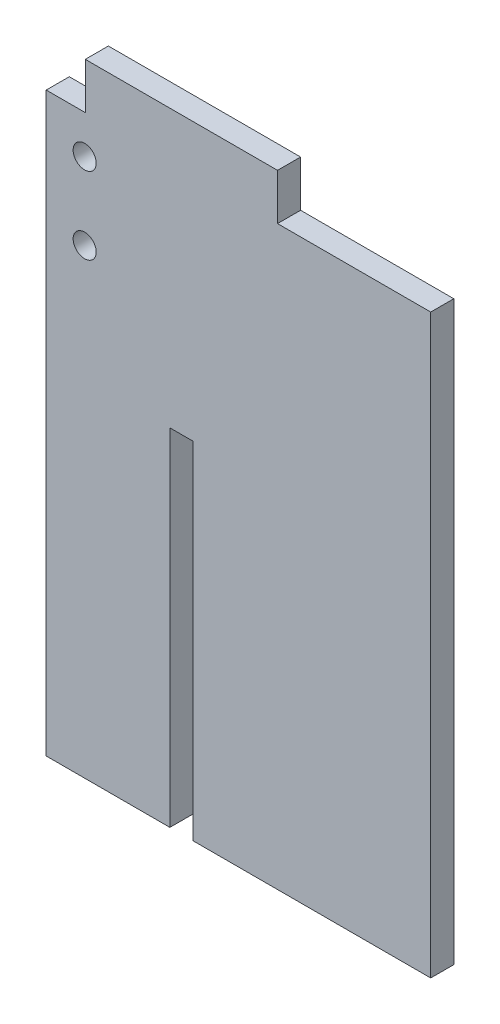
ISO-10303-21;
HEADER;
FILE_DESCRIPTION(('STEP AP214'),'2;1');
FILE_NAME('part.step','',(''),(''),'','','');
FILE_SCHEMA(('AUTOMOTIVE_DESIGN { 1 0 10303 214 1 1 1 1 }'));
ENDSEC;
DATA;
#1=APPLICATION_CONTEXT('core data for automotive mechanical design processes');
#2=APPLICATION_PROTOCOL_DEFINITION('international standard','automotive_design',2000,#1);
#3=PRODUCT_CONTEXT('',#1,'mechanical');
#4=PRODUCT('Part','Part','',(#3));
#5=PRODUCT_RELATED_PRODUCT_CATEGORY('part','',(#4));
#6=PRODUCT_DEFINITION_FORMATION('','',#4);
#7=PRODUCT_DEFINITION_CONTEXT('part definition',#1,'design');
#8=PRODUCT_DEFINITION('design','',#6,#7);
#9=PRODUCT_DEFINITION_SHAPE('','',#8);
#10=(LENGTH_UNIT() NAMED_UNIT(*) SI_UNIT(.MILLI.,.METRE.));
#11=(NAMED_UNIT(*) PLANE_ANGLE_UNIT() SI_UNIT($,.RADIAN.));
#12=(NAMED_UNIT(*) SI_UNIT($,.STERADIAN.) SOLID_ANGLE_UNIT());
#13=UNCERTAINTY_MEASURE_WITH_UNIT(LENGTH_MEASURE(1.E-05),#10,'distance_accuracy_value','');
#14=(GEOMETRIC_REPRESENTATION_CONTEXT(3) GLOBAL_UNCERTAINTY_ASSIGNED_CONTEXT((#13)) GLOBAL_UNIT_ASSIGNED_CONTEXT((#10,
#11,#12)) REPRESENTATION_CONTEXT('',''));
#15=CARTESIAN_POINT('',(0.,0.,0.));
#16=DIRECTION('',(0.,0.,1.));
#17=DIRECTION('',(1.,0.,0.));
#18=AXIS2_PLACEMENT_3D('',#15,#16,#17);
#19=CARTESIAN_POINT('',(12.5000000000001,67.8577319972864,2.99999999999996));
#20=DIRECTION('',(-1.,0.,0.));
#21=DIRECTION('',(0.,0.,1.));
#22=AXIS2_PLACEMENT_3D('',#19,#20,#21);
#23=PLANE('',#22);
#24=DIRECTION('',(0.,1.,0.));
#25=VECTOR('',#24,1.);
#26=CARTESIAN_POINT('',(12.5000000000001,67.8577319972864,0.));
#27=LINE('',#26,#25);
#28=CARTESIAN_POINT('',(12.5000000000001,67.8577319972864,0.));
#29=VERTEX_POINT('',#28);
#30=CARTESIAN_POINT('',(12.5000000000001,73.8577319972864,0.));
#31=VERTEX_POINT('',#30);
#32=EDGE_CURVE('E158',#29,#31,#27,.T.);
#33=ORIENTED_EDGE('',*,*,#32,.T.);
#34=DIRECTION('',(0.,0.,-1.));
#35=VECTOR('',#34,1.);
#36=CARTESIAN_POINT('',(12.5000000000001,73.8577319972864,2.99999999999998));
#37=LINE('',#36,#35);
#38=CARTESIAN_POINT('',(12.5000000000001,73.8577319972864,2.99999999999998));
#39=VERTEX_POINT('',#38);
#40=EDGE_CURVE('E11',#39,#31,#37,.T.);
#41=ORIENTED_EDGE('',*,*,#40,.F.);
#42=DIRECTION('',(0.,1.,0.));
#43=VECTOR('',#42,1.);
#44=CARTESIAN_POINT('',(12.5000000000001,67.8577319972864,2.99999999999996));
#45=LINE('',#44,#43);
#46=CARTESIAN_POINT('',(12.5000000000001,67.8577319972864,2.99999999999996));
#47=VERTEX_POINT('',#46);
#48=EDGE_CURVE('E181',#47,#39,#45,.T.);
#49=ORIENTED_EDGE('',*,*,#48,.F.);
#50=DIRECTION('',(0.,0.,-1.));
#51=VECTOR('',#50,1.);
#52=CARTESIAN_POINT('',(12.5000000000001,67.8577319972864,2.99999999999996));
#53=LINE('',#52,#51);
#54=EDGE_CURVE('E154',#47,#29,#53,.T.);
#55=ORIENTED_EDGE('',*,*,#54,.T.);
#56=EDGE_LOOP('',(#33,#41,#49,#55));
#57=FACE_BOUND('',#56,.T.);
#58=ADVANCED_FACE('F38',(#57),#23,.F.);
#59=CARTESIAN_POINT('',(12.5000000000001,73.8577319972864,2.99999999999998));
#60=DIRECTION('',(0.,-1.,0.));
#61=DIRECTION('',(0.,0.,-1.));
#62=AXIS2_PLACEMENT_3D('',#59,#60,#61);
#63=PLANE('',#62);
#64=DIRECTION('',(-1.,0.,0.));
#65=VECTOR('',#64,1.);
#66=CARTESIAN_POINT('',(12.5000000000001,73.8577319972864,0.));
#67=LINE('',#66,#65);
#68=CARTESIAN_POINT('',(-12.4999999999999,73.8577319972863,0.));
#69=VERTEX_POINT('',#68);
#70=EDGE_CURVE('E161',#31,#69,#67,.T.);
#71=ORIENTED_EDGE('',*,*,#70,.T.);
#72=DIRECTION('',(0.,0.,-1.));
#73=VECTOR('',#72,1.);
#74=CARTESIAN_POINT('',(-12.4999999999999,73.8577319972863,2.99999999999995));
#75=LINE('',#74,#73);
#76=CARTESIAN_POINT('',(-12.4999999999999,73.8577319972863,2.99999999999995));
#77=VERTEX_POINT('',#76);
#78=EDGE_CURVE('E46',#77,#69,#75,.T.);
#79=ORIENTED_EDGE('',*,*,#78,.F.);
#80=DIRECTION('',(-1.,0.,0.));
#81=VECTOR('',#80,1.);
#82=CARTESIAN_POINT('',(12.5000000000001,73.8577319972864,2.99999999999998));
#83=LINE('',#82,#81);
#84=EDGE_CURVE('E109',#39,#77,#83,.T.);
#85=ORIENTED_EDGE('',*,*,#84,.F.);
#86=ORIENTED_EDGE('',*,*,#40,.T.);
#87=EDGE_LOOP('',(#71,#79,#85,#86));
#88=FACE_BOUND('',#87,.T.);
#89=ADVANCED_FACE('F260',(#88),#63,.F.);
#90=CARTESIAN_POINT('',(-12.4999999999999,73.8577319972863,2.99999999999995));
#91=DIRECTION('',(1.,0.,0.));
#92=DIRECTION('',(0.,0.,-1.));
#93=AXIS2_PLACEMENT_3D('',#90,#91,#92);
#94=PLANE('',#93);
#95=DIRECTION('',(0.,-1.,0.));
#96=VECTOR('',#95,1.);
#97=CARTESIAN_POINT('',(-12.4999999999999,73.8577319972863,0.));
#98=LINE('',#97,#96);
#99=CARTESIAN_POINT('',(-12.4999999999999,67.8577319972863,0.));
#100=VERTEX_POINT('',#99);
#101=EDGE_CURVE('E164',#69,#100,#98,.T.);
#102=ORIENTED_EDGE('',*,*,#101,.T.);
#103=DIRECTION('',(0.,0.,-1.));
#104=VECTOR('',#103,1.);
#105=CARTESIAN_POINT('',(-12.4999999999999,67.8577319972863,2.99999999999992));
#106=LINE('',#105,#104);
#107=CARTESIAN_POINT('',(-12.4999999999999,67.8577319972863,2.99999999999992));
#108=VERTEX_POINT('',#107);
#109=EDGE_CURVE('E200',#108,#100,#106,.T.);
#110=ORIENTED_EDGE('',*,*,#109,.F.);
#111=DIRECTION('',(0.,-1.,0.));
#112=VECTOR('',#111,1.);
#113=CARTESIAN_POINT('',(-12.4999999999999,73.8577319972863,2.99999999999995));
#114=LINE('',#113,#112);
#115=EDGE_CURVE('E208',#77,#108,#114,.T.);
#116=ORIENTED_EDGE('',*,*,#115,.F.);
#117=ORIENTED_EDGE('',*,*,#78,.T.);
#118=EDGE_LOOP('',(#102,#110,#116,#117));
#119=FACE_BOUND('',#118,.T.);
#120=ADVANCED_FACE('F206',(#119),#94,.F.);
#121=CARTESIAN_POINT('',(-12.4999999999999,67.8577319972863,2.99999999999992));
#122=DIRECTION('',(0.,-1.,0.));
#123=DIRECTION('',(0.,0.,-1.));
#124=AXIS2_PLACEMENT_3D('',#121,#122,#123);
#125=PLANE('',#124);
#126=DIRECTION('',(-1.,0.,0.));
#127=VECTOR('',#126,1.);
#128=CARTESIAN_POINT('',(-12.4999999999999,67.8577319972863,0.));
#129=LINE('',#128,#127);
#130=CARTESIAN_POINT('',(-17.5799999999999,67.8577319972863,0.));
#131=VERTEX_POINT('',#130);
#132=EDGE_CURVE('E166',#100,#131,#129,.T.);
#133=ORIENTED_EDGE('',*,*,#132,.T.);
#134=DIRECTION('',(0.,0.,-1.));
#135=VECTOR('',#134,1.);
#136=CARTESIAN_POINT('',(-17.5799999999999,67.8577319972863,2.99999999999992));
#137=LINE('',#136,#135);
#138=CARTESIAN_POINT('',(-17.5799999999999,67.8577319972863,2.99999999999992));
#139=VERTEX_POINT('',#138);
#140=EDGE_CURVE('E197',#139,#131,#137,.T.);
#141=ORIENTED_EDGE('',*,*,#140,.F.);
#142=DIRECTION('',(-1.,0.,0.));
#143=VECTOR('',#142,1.);
#144=CARTESIAN_POINT('',(-12.4999999999999,67.8577319972863,2.99999999999992));
#145=LINE('',#144,#143);
#146=EDGE_CURVE('E226',#108,#139,#145,.T.);
#147=ORIENTED_EDGE('',*,*,#146,.F.);
#148=ORIENTED_EDGE('',*,*,#109,.T.);
#149=EDGE_LOOP('',(#133,#141,#147,#148));
#150=FACE_BOUND('',#149,.T.);
#151=ADVANCED_FACE('F217',(#150),#125,.F.);
#152=CARTESIAN_POINT('',(-17.5799999999999,67.8577319972863,2.99999999999992));
#153=DIRECTION('',(1.,0.,0.));
#154=DIRECTION('',(0.,1.,0.));
#155=AXIS2_PLACEMENT_3D('',#152,#153,#154);
#156=PLANE('',#155);
#157=DIRECTION('',(0.,-1.,0.));
#158=VECTOR('',#157,1.);
#159=CARTESIAN_POINT('',(-17.5799999999999,67.8577319972863,0.));
#160=LINE('',#159,#158);
#161=CARTESIAN_POINT('',(-17.58,-7.14226800271373,0.));
#162=VERTEX_POINT('',#161);
#163=EDGE_CURVE('E168',#131,#162,#160,.T.);
#164=ORIENTED_EDGE('',*,*,#163,.T.);
#165=DIRECTION('',(0.,0.,-1.));
#166=VECTOR('',#165,1.);
#167=CARTESIAN_POINT('',(-17.5799999999999,-7.14226800271373,2.99999999999998));
#168=LINE('',#167,#166);
#169=CARTESIAN_POINT('',(-17.5799999999999,-7.14226800271373,2.99999999999998));
#170=VERTEX_POINT('',#169);
#171=EDGE_CURVE('E194',#170,#162,#168,.T.);
#172=ORIENTED_EDGE('',*,*,#171,.F.);
#173=DIRECTION('',(0.,-1.,0.));
#174=VECTOR('',#173,1.);
#175=CARTESIAN_POINT('',(-17.5799999999999,67.8577319972863,2.99999999999992));
#176=LINE('',#175,#174);
#177=EDGE_CURVE('E223',#139,#170,#176,.T.);
#178=ORIENTED_EDGE('',*,*,#177,.F.);
#179=ORIENTED_EDGE('',*,*,#140,.T.);
#180=EDGE_LOOP('',(#164,#172,#178,#179));
#181=FACE_BOUND('',#180,.T.);
#182=ADVANCED_FACE('F221',(#181),#156,.F.);
#183=CARTESIAN_POINT('',(-17.5799999999999,-7.14226800271373,2.99999999999998));
#184=DIRECTION('',(0.,1.,0.));
#185=DIRECTION('',(0.,0.,1.));
#186=AXIS2_PLACEMENT_3D('',#183,#184,#185);
#187=PLANE('',#186);
#188=DIRECTION('',(1.,0.,0.));
#189=VECTOR('',#188,1.);
#190=CARTESIAN_POINT('',(-17.58,-7.14226800271373,0.));
#191=LINE('',#190,#189);
#192=CARTESIAN_POINT('',(-1.5,-7.14226800271361,0.));
#193=VERTEX_POINT('',#192);
#194=EDGE_CURVE('E170',#162,#193,#191,.T.);
#195=ORIENTED_EDGE('',*,*,#194,.T.);
#196=DIRECTION('',(0.,0.,-1.));
#197=VECTOR('',#196,1.);
#198=CARTESIAN_POINT('',(-1.4999999999999,-7.14226800271361,2.99999999999999));
#199=LINE('',#198,#197);
#200=CARTESIAN_POINT('',(-1.4999999999999,-7.14226800271361,2.99999999999999));
#201=VERTEX_POINT('',#200);
#202=EDGE_CURVE('E191',#201,#193,#199,.T.);
#203=ORIENTED_EDGE('',*,*,#202,.F.);
#204=DIRECTION('',(1.,0.,0.));
#205=VECTOR('',#204,1.);
#206=CARTESIAN_POINT('',(-17.5799999999999,-7.14226800271373,2.99999999999998));
#207=LINE('',#206,#205);
#208=EDGE_CURVE('E225',#170,#201,#207,.T.);
#209=ORIENTED_EDGE('',*,*,#208,.F.);
#210=ORIENTED_EDGE('',*,*,#171,.T.);
#211=EDGE_LOOP('',(#195,#203,#209,#210));
#212=FACE_BOUND('',#211,.T.);
#213=ADVANCED_FACE('F273',(#212),#187,.F.);
#214=CARTESIAN_POINT('',(-1.4999999999999,-7.14226800271361,2.99999999999999));
#215=DIRECTION('',(-1.,0.,0.));
#216=DIRECTION('',(0.,-1.,0.));
#217=AXIS2_PLACEMENT_3D('',#214,#215,#216);
#218=PLANE('',#217);
#219=DIRECTION('',(0.,1.,0.));
#220=VECTOR('',#219,1.);
#221=CARTESIAN_POINT('',(-1.5,-7.14226800271361,0.));
#222=LINE('',#221,#220);
#223=CARTESIAN_POINT('',(-1.49999999999995,37.8577319972864,0.));
#224=VERTEX_POINT('',#223);
#225=EDGE_CURVE('E172',#193,#224,#222,.T.);
#226=ORIENTED_EDGE('',*,*,#225,.T.);
#227=DIRECTION('',(0.,0.,-1.));
#228=VECTOR('',#227,1.);
#229=CARTESIAN_POINT('',(-1.49999999999989,37.8577319972864,3.));
#230=LINE('',#229,#228);
#231=CARTESIAN_POINT('',(-1.49999999999989,37.8577319972864,3.));
#232=VERTEX_POINT('',#231);
#233=EDGE_CURVE('E188',#232,#224,#230,.T.);
#234=ORIENTED_EDGE('',*,*,#233,.F.);
#235=DIRECTION('',(0.,1.,0.));
#236=VECTOR('',#235,1.);
#237=CARTESIAN_POINT('',(-1.4999999999999,-7.14226800271361,2.99999999999999));
#238=LINE('',#237,#236);
#239=EDGE_CURVE('E228',#201,#232,#238,.T.);
#240=ORIENTED_EDGE('',*,*,#239,.F.);
#241=ORIENTED_EDGE('',*,*,#202,.T.);
#242=EDGE_LOOP('',(#226,#234,#240,#241));
#243=FACE_BOUND('',#242,.T.);
#244=ADVANCED_FACE('F276',(#243),#218,.F.);
#245=CARTESIAN_POINT('',(-1.49999999999989,37.8577319972864,3.));
#246=DIRECTION('',(0.,1.,0.));
#247=DIRECTION('',(0.,0.,1.));
#248=AXIS2_PLACEMENT_3D('',#245,#246,#247);
#249=PLANE('',#248);
#250=DIRECTION('',(1.,0.,0.));
#251=VECTOR('',#250,1.);
#252=CARTESIAN_POINT('',(-1.49999999999995,37.8577319972864,0.));
#253=LINE('',#252,#251);
#254=CARTESIAN_POINT('',(1.50000000000007,37.8577319972864,0.));
#255=VERTEX_POINT('',#254);
#256=EDGE_CURVE('E174',#224,#255,#253,.T.);
#257=ORIENTED_EDGE('',*,*,#256,.T.);
#258=DIRECTION('',(0.,0.,-1.));
#259=VECTOR('',#258,1.);
#260=CARTESIAN_POINT('',(1.50000000000004,37.8577319972864,2.99999999999998));
#261=LINE('',#260,#259);
#262=CARTESIAN_POINT('',(1.50000000000004,37.8577319972864,2.99999999999998));
#263=VERTEX_POINT('',#262);
#264=EDGE_CURVE('E185',#263,#255,#261,.T.);
#265=ORIENTED_EDGE('',*,*,#264,.F.);
#266=DIRECTION('',(1.,0.,0.));
#267=VECTOR('',#266,1.);
#268=CARTESIAN_POINT('',(-1.49999999999989,37.8577319972864,3.));
#269=LINE('',#268,#267);
#270=EDGE_CURVE('E234',#232,#263,#269,.T.);
#271=ORIENTED_EDGE('',*,*,#270,.F.);
#272=ORIENTED_EDGE('',*,*,#233,.T.);
#273=EDGE_LOOP('',(#257,#265,#271,#272));
#274=FACE_BOUND('',#273,.T.);
#275=ADVANCED_FACE('F240',(#274),#249,.F.);
#276=CARTESIAN_POINT('',(1.50000000000004,37.8577319972864,2.99999999999998));
#277=DIRECTION('',(1.,0.,0.));
#278=DIRECTION('',(0.,1.,0.));
#279=AXIS2_PLACEMENT_3D('',#276,#277,#278);
#280=PLANE('',#279);
#281=DIRECTION('',(0.,-1.,0.));
#282=VECTOR('',#281,1.);
#283=CARTESIAN_POINT('',(1.50000000000007,37.8577319972864,0.));
#284=LINE('',#283,#282);
#285=CARTESIAN_POINT('',(1.50000000000007,-7.14226800271356,0.));
#286=VERTEX_POINT('',#285);
#287=EDGE_CURVE('E176',#255,#286,#284,.T.);
#288=ORIENTED_EDGE('',*,*,#287,.T.);
#289=DIRECTION('',(0.,0.,-1.));
#290=VECTOR('',#289,1.);
#291=CARTESIAN_POINT('',(1.50000000000007,-7.14226800271356,2.99999999999999));
#292=LINE('',#291,#290);
#293=CARTESIAN_POINT('',(1.50000000000007,-7.14226800271356,2.99999999999999));
#294=VERTEX_POINT('',#293);
#295=EDGE_CURVE('E149',#294,#286,#292,.T.);
#296=ORIENTED_EDGE('',*,*,#295,.F.);
#297=DIRECTION('',(0.,-1.,0.));
#298=VECTOR('',#297,1.);
#299=CARTESIAN_POINT('',(1.50000000000004,37.8577319972864,2.99999999999998));
#300=LINE('',#299,#298);
#301=EDGE_CURVE('E140',#263,#294,#300,.T.);
#302=ORIENTED_EDGE('',*,*,#301,.F.);
#303=ORIENTED_EDGE('',*,*,#264,.T.);
#304=EDGE_LOOP('',(#288,#296,#302,#303));
#305=FACE_BOUND('',#304,.T.);
#306=ADVANCED_FACE('F244',(#305),#280,.F.);
#307=CARTESIAN_POINT('',(1.50000000000007,-7.14226800271356,2.99999999999999));
#308=DIRECTION('',(0.,1.,0.));
#309=DIRECTION('',(-1.,0.,0.));
#310=AXIS2_PLACEMENT_3D('',#307,#308,#309);
#311=PLANE('',#310);
#312=DIRECTION('',(1.,0.,0.));
#313=VECTOR('',#312,1.);
#314=CARTESIAN_POINT('',(1.50000000000007,-7.14226800271356,0.));
#315=LINE('',#314,#313);
#316=CARTESIAN_POINT('',(32.42,-7.14226800271356,0.));
#317=VERTEX_POINT('',#316);
#318=EDGE_CURVE('E148',#286,#317,#315,.T.);
#319=ORIENTED_EDGE('',*,*,#318,.T.);
#320=DIRECTION('',(0.,0.,-1.));
#321=VECTOR('',#320,1.);
#322=CARTESIAN_POINT('',(32.42,-7.14226800271356,3.));
#323=LINE('',#322,#321);
#324=CARTESIAN_POINT('',(32.42,-7.14226800271356,3.));
#325=VERTEX_POINT('',#324);
#326=EDGE_CURVE('E145',#325,#317,#323,.T.);
#327=ORIENTED_EDGE('',*,*,#326,.F.);
#328=DIRECTION('',(1.,0.,0.));
#329=VECTOR('',#328,1.);
#330=CARTESIAN_POINT('',(1.50000000000007,-7.14226800271356,2.99999999999999));
#331=LINE('',#330,#329);
#332=EDGE_CURVE('E134',#294,#325,#331,.T.);
#333=ORIENTED_EDGE('',*,*,#332,.F.);
#334=ORIENTED_EDGE('',*,*,#295,.T.);
#335=EDGE_LOOP('',(#319,#327,#333,#334));
#336=FACE_BOUND('',#335,.T.);
#337=ADVANCED_FACE('F146',(#336),#311,.F.);
#338=CARTESIAN_POINT('',(32.42,-7.14226800271356,3.));
#339=DIRECTION('',(-1.,0.,0.));
#340=DIRECTION('',(0.,0.,1.));
#341=AXIS2_PLACEMENT_3D('',#338,#339,#340);
#342=PLANE('',#341);
#343=DIRECTION('',(0.,1.,0.));
#344=VECTOR('',#343,1.);
#345=CARTESIAN_POINT('',(32.42,-7.14226800271356,0.));
#346=LINE('',#345,#344);
#347=CARTESIAN_POINT('',(32.4200000000001,67.8577319972864,0.));
#348=VERTEX_POINT('',#347);
#349=EDGE_CURVE('E95',#317,#348,#346,.T.);
#350=ORIENTED_EDGE('',*,*,#349,.T.);
#351=DIRECTION('',(0.,0.,-1.));
#352=VECTOR('',#351,1.);
#353=CARTESIAN_POINT('',(32.4200000000001,67.8577319972864,2.99999999999996));
#354=LINE('',#353,#352);
#355=CARTESIAN_POINT('',(32.4200000000001,67.8577319972864,2.99999999999996));
#356=VERTEX_POINT('',#355);
#357=EDGE_CURVE('E150',#356,#348,#354,.T.);
#358=ORIENTED_EDGE('',*,*,#357,.F.);
#359=DIRECTION('',(0.,1.,0.));
#360=VECTOR('',#359,1.);
#361=CARTESIAN_POINT('',(32.42,-7.14226800271356,3.));
#362=LINE('',#361,#360);
#363=EDGE_CURVE('E138',#325,#356,#362,.T.);
#364=ORIENTED_EDGE('',*,*,#363,.F.);
#365=ORIENTED_EDGE('',*,*,#326,.T.);
#366=EDGE_LOOP('',(#350,#358,#364,#365));
#367=FACE_BOUND('',#366,.T.);
#368=ADVANCED_FACE('F152',(#367),#342,.F.);
#369=CARTESIAN_POINT('',(32.4200000000001,67.8577319972864,2.99999999999996));
#370=DIRECTION('',(0.,-1.,0.));
#371=DIRECTION('',(1.,0.,0.));
#372=AXIS2_PLACEMENT_3D('',#369,#370,#371);
#373=PLANE('',#372);
#374=DIRECTION('',(-1.,0.,0.));
#375=VECTOR('',#374,1.);
#376=CARTESIAN_POINT('',(32.4200000000001,67.8577319972864,0.));
#377=LINE('',#376,#375);
#378=EDGE_CURVE('E101',#348,#29,#377,.T.);
#379=ORIENTED_EDGE('',*,*,#378,.T.);
#380=ORIENTED_EDGE('',*,*,#54,.F.);
#381=DIRECTION('',(-1.,0.,0.));
#382=VECTOR('',#381,1.);
#383=CARTESIAN_POINT('',(32.4200000000001,67.8577319972864,2.99999999999996));
#384=LINE('',#383,#382);
#385=EDGE_CURVE('E54',#356,#47,#384,.T.);
#386=ORIENTED_EDGE('',*,*,#385,.F.);
#387=ORIENTED_EDGE('',*,*,#357,.T.);
#388=EDGE_LOOP('',(#379,#380,#386,#387));
#389=FACE_BOUND('',#388,.T.);
#390=ADVANCED_FACE('F248',(#389),#373,.F.);
#391=CARTESIAN_POINT('',(0.,0.,3.00000000000002));
#392=DIRECTION('',(0.,0.,1.));
#393=DIRECTION('',(1.,0.,0.));
#394=AXIS2_PLACEMENT_3D('',#391,#392,#393);
#395=PLANE('',#394);
#396=CARTESIAN_POINT('',(-12.5799999999999,62.8577319972863,2.99999999999997));
#397=DIRECTION('',(0.,0.,1.));
#398=DIRECTION('',(1.,0.,0.));
#399=AXIS2_PLACEMENT_3D('',#396,#397,#398);
#400=CIRCLE('',#399,1.5);
#401=CARTESIAN_POINT('',(-11.0799999999999,62.8577319972863,2.99999999999997));
#402=VERTEX_POINT('',#401);
#403=EDGE_CURVE('E329',#402,#402,#400,.T.);
#404=ORIENTED_EDGE('',*,*,#403,.F.);
#405=EDGE_LOOP('',(#404));
#406=FACE_BOUND('',#405,.T.);
#407=CARTESIAN_POINT('',(-12.5799999999999,52.8577319972863,2.99999999999997));
#408=DIRECTION('',(0.,0.,1.));
#409=DIRECTION('',(1.,0.,0.));
#410=AXIS2_PLACEMENT_3D('',#407,#408,#409);
#411=CIRCLE('',#410,1.5);
#412=CARTESIAN_POINT('',(-11.0799999999999,52.8577319972863,2.99999999999997));
#413=VERTEX_POINT('',#412);
#414=EDGE_CURVE('E334',#413,#413,#411,.T.);
#415=ORIENTED_EDGE('',*,*,#414,.F.);
#416=EDGE_LOOP('',(#415));
#417=FACE_BOUND('',#416,.T.);
#418=ORIENTED_EDGE('',*,*,#48,.T.);
#419=ORIENTED_EDGE('',*,*,#84,.T.);
#420=ORIENTED_EDGE('',*,*,#115,.T.);
#421=ORIENTED_EDGE('',*,*,#146,.T.);
#422=ORIENTED_EDGE('',*,*,#177,.T.);
#423=ORIENTED_EDGE('',*,*,#208,.T.);
#424=ORIENTED_EDGE('',*,*,#239,.T.);
#425=ORIENTED_EDGE('',*,*,#270,.T.);
#426=ORIENTED_EDGE('',*,*,#301,.T.);
#427=ORIENTED_EDGE('',*,*,#332,.T.);
#428=ORIENTED_EDGE('',*,*,#363,.T.);
#429=ORIENTED_EDGE('',*,*,#385,.T.);
#430=EDGE_LOOP('',(#418,#419,#420,#421,#422,#423,#424,#425,#426,#427,#428,#429));
#431=FACE_BOUND('',#430,.T.);
#432=ADVANCED_FACE('F136',(#406,#417,#431),#395,.T.);
#433=CARTESIAN_POINT('',(0.,0.,0.));
#434=DIRECTION('',(0.,0.,1.));
#435=DIRECTION('',(1.,0.,0.));
#436=AXIS2_PLACEMENT_3D('',#433,#434,#435);
#437=PLANE('',#436);
#438=CARTESIAN_POINT('',(-12.5799999999999,62.8577319972863,0.));
#439=DIRECTION('',(0.,0.,1.));
#440=DIRECTION('',(1.,0.,0.));
#441=AXIS2_PLACEMENT_3D('',#438,#439,#440);
#442=CIRCLE('',#441,1.5);
#443=CARTESIAN_POINT('',(-11.0799999999999,62.8577319972863,0.));
#444=VERTEX_POINT('',#443);
#445=EDGE_CURVE('E162',#444,#444,#442,.T.);
#446=ORIENTED_EDGE('',*,*,#445,.T.);
#447=EDGE_LOOP('',(#446));
#448=FACE_BOUND('',#447,.T.);
#449=CARTESIAN_POINT('',(-12.5799999999999,52.8577319972863,0.));
#450=DIRECTION('',(0.,0.,1.));
#451=DIRECTION('',(1.,0.,0.));
#452=AXIS2_PLACEMENT_3D('',#449,#450,#451);
#453=CIRCLE('',#452,1.5);
#454=CARTESIAN_POINT('',(-11.0799999999999,52.8577319972863,0.));
#455=VERTEX_POINT('',#454);
#456=EDGE_CURVE('E330',#455,#455,#453,.T.);
#457=ORIENTED_EDGE('',*,*,#456,.T.);
#458=EDGE_LOOP('',(#457));
#459=FACE_BOUND('',#458,.T.);
#460=ORIENTED_EDGE('',*,*,#32,.F.);
#461=ORIENTED_EDGE('',*,*,#378,.F.);
#462=ORIENTED_EDGE('',*,*,#349,.F.);
#463=ORIENTED_EDGE('',*,*,#318,.F.);
#464=ORIENTED_EDGE('',*,*,#287,.F.);
#465=ORIENTED_EDGE('',*,*,#256,.F.);
#466=ORIENTED_EDGE('',*,*,#225,.F.);
#467=ORIENTED_EDGE('',*,*,#194,.F.);
#468=ORIENTED_EDGE('',*,*,#163,.F.);
#469=ORIENTED_EDGE('',*,*,#132,.F.);
#470=ORIENTED_EDGE('',*,*,#101,.F.);
#471=ORIENTED_EDGE('',*,*,#70,.F.);
#472=EDGE_LOOP('',(#460,#461,#462,#463,#464,#465,#466,#467,#468,#469,#470,#471));
#473=FACE_BOUND('',#472,.T.);
#474=ADVANCED_FACE('F212',(#448,#459,#473),#437,.F.);
#475=CARTESIAN_POINT('',(-12.5799999999999,52.8577319972863,0.));
#476=DIRECTION('',(0.,0.,1.));
#477=DIRECTION('',(1.,0.,0.));
#478=AXIS2_PLACEMENT_3D('',#475,#476,#477);
#479=CYLINDRICAL_SURFACE('',#478,1.5);
#480=ORIENTED_EDGE('',*,*,#456,.F.);
#481=EDGE_LOOP('',(#480));
#482=FACE_BOUND('',#481,.T.);
#483=ORIENTED_EDGE('',*,*,#414,.T.);
#484=EDGE_LOOP('',(#483));
#485=FACE_BOUND('',#484,.T.);
#486=ADVANCED_FACE('F307',(#482,#485),#479,.F.);
#487=CARTESIAN_POINT('',(-12.5799999999999,62.8577319972863,0.));
#488=DIRECTION('',(0.,0.,1.));
#489=DIRECTION('',(1.,0.,0.));
#490=AXIS2_PLACEMENT_3D('',#487,#488,#489);
#491=CYLINDRICAL_SURFACE('',#490,1.5);
#492=ORIENTED_EDGE('',*,*,#445,.F.);
#493=EDGE_LOOP('',(#492));
#494=FACE_BOUND('',#493,.T.);
#495=ORIENTED_EDGE('',*,*,#403,.T.);
#496=EDGE_LOOP('',(#495));
#497=FACE_BOUND('',#496,.T.);
#498=ADVANCED_FACE('F314',(#494,#497),#491,.F.);
#499=CLOSED_SHELL('',(#58,#89,#120,#151,#182,#213,#244,#275,#306,#337,#368,#390,#432,#474,#486,#498));
#500=MANIFOLD_SOLID_BREP('B2',#499);
#501=ADVANCED_BREP_SHAPE_REPRESENTATION('',(#18,#500),#14);
#502=SHAPE_DEFINITION_REPRESENTATION(#9,#501);
ENDSEC;
END-ISO-10303-21;
